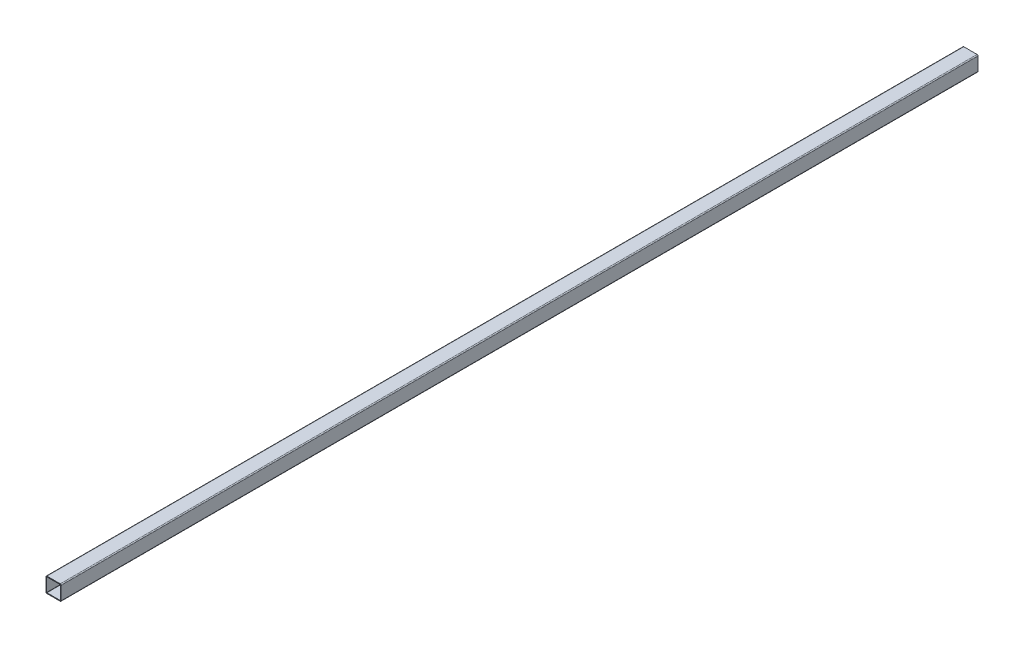
ISO-10303-21;
HEADER;
FILE_DESCRIPTION(('STEP AP214'),'2;1');
FILE_NAME('part.step','',(''),(''),'','','');
FILE_SCHEMA(('AUTOMOTIVE_DESIGN { 1 0 10303 214 1 1 1 1 }'));
ENDSEC;
DATA;
#1=APPLICATION_CONTEXT('core data for automotive mechanical design processes');
#2=APPLICATION_PROTOCOL_DEFINITION('international standard','automotive_design',2000,#1);
#3=PRODUCT_CONTEXT('',#1,'mechanical');
#4=PRODUCT('Part','Part','',(#3));
#5=PRODUCT_RELATED_PRODUCT_CATEGORY('part','',(#4));
#6=PRODUCT_DEFINITION_FORMATION('','',#4);
#7=PRODUCT_DEFINITION_CONTEXT('part definition',#1,'design');
#8=PRODUCT_DEFINITION('design','',#6,#7);
#9=PRODUCT_DEFINITION_SHAPE('','',#8);
#10=(LENGTH_UNIT() NAMED_UNIT(*) SI_UNIT(.MILLI.,.METRE.));
#11=(NAMED_UNIT(*) PLANE_ANGLE_UNIT() SI_UNIT($,.RADIAN.));
#12=(NAMED_UNIT(*) SI_UNIT($,.STERADIAN.) SOLID_ANGLE_UNIT());
#13=UNCERTAINTY_MEASURE_WITH_UNIT(LENGTH_MEASURE(1.E-05),#10,'distance_accuracy_value','');
#14=(GEOMETRIC_REPRESENTATION_CONTEXT(3) GLOBAL_UNCERTAINTY_ASSIGNED_CONTEXT((#13)) GLOBAL_UNIT_ASSIGNED_CONTEXT((#10,
#11,#12)) REPRESENTATION_CONTEXT('',''));
#15=CARTESIAN_POINT('',(0.,0.,0.));
#16=DIRECTION('',(0.,0.,1.));
#17=DIRECTION('',(1.,0.,0.));
#18=AXIS2_PLACEMENT_3D('',#15,#16,#17);
#19=CARTESIAN_POINT('',(14.,-14.,-968.));
#20=DIRECTION('',(0.,0.,1.));
#21=DIRECTION('',(1.,0.,0.));
#22=AXIS2_PLACEMENT_3D('',#19,#20,#21);
#23=CYLINDRICAL_SURFACE('',#22,2.);
#24=DIRECTION('',(0.,0.,1.));
#25=VECTOR('',#24,1.);
#26=CARTESIAN_POINT('',(16.,-14.,-968.));
#27=LINE('',#26,#25);
#28=CARTESIAN_POINT('',(16.,-14.,-968.));
#29=VERTEX_POINT('',#28);
#30=CARTESIAN_POINT('',(16.,-14.,968.));
#31=VERTEX_POINT('',#30);
#32=EDGE_CURVE('E37',#29,#31,#27,.T.);
#33=ORIENTED_EDGE('',*,*,#32,.T.);
#34=CARTESIAN_POINT('',(14.,-14.,968.));
#35=DIRECTION('',(0.,0.,1.));
#36=DIRECTION('',(1.,0.,0.));
#37=AXIS2_PLACEMENT_3D('',#34,#35,#36);
#38=CIRCLE('',#37,2.);
#39=CARTESIAN_POINT('',(14.,-16.,968.));
#40=VERTEX_POINT('',#39);
#41=EDGE_CURVE('E190',#40,#31,#38,.T.);
#42=ORIENTED_EDGE('',*,*,#41,.F.);
#43=DIRECTION('',(0.,0.,1.));
#44=VECTOR('',#43,1.);
#45=CARTESIAN_POINT('',(14.,-16.,-968.));
#46=LINE('',#45,#44);
#47=CARTESIAN_POINT('',(14.,-16.,-968.));
#48=VERTEX_POINT('',#47);
#49=EDGE_CURVE('E11',#48,#40,#46,.T.);
#50=ORIENTED_EDGE('',*,*,#49,.F.);
#51=CARTESIAN_POINT('',(14.,-14.,-968.));
#52=DIRECTION('',(0.,0.,1.));
#53=DIRECTION('',(1.,0.,0.));
#54=AXIS2_PLACEMENT_3D('',#51,#52,#53);
#55=CIRCLE('',#54,2.);
#56=EDGE_CURVE('E233',#48,#29,#55,.T.);
#57=ORIENTED_EDGE('',*,*,#56,.T.);
#58=EDGE_LOOP('',(#33,#42,#50,#57));
#59=FACE_BOUND('',#58,.T.);
#60=ADVANCED_FACE('F34',(#59),#23,.T.);
#61=CARTESIAN_POINT('',(-14.,-16.,-968.));
#62=DIRECTION('',(0.,-1.,0.));
#63=DIRECTION('',(0.,0.,-1.));
#64=AXIS2_PLACEMENT_3D('',#61,#62,#63);
#65=PLANE('',#64);
#66=ORIENTED_EDGE('',*,*,#49,.T.);
#67=DIRECTION('',(1.,0.,0.));
#68=VECTOR('',#67,1.);
#69=CARTESIAN_POINT('',(-14.,-16.,968.));
#70=LINE('',#69,#68);
#71=CARTESIAN_POINT('',(-14.,-16.,968.));
#72=VERTEX_POINT('',#71);
#73=EDGE_CURVE('E211',#72,#40,#70,.T.);
#74=ORIENTED_EDGE('',*,*,#73,.F.);
#75=DIRECTION('',(0.,0.,1.));
#76=VECTOR('',#75,1.);
#77=CARTESIAN_POINT('',(-14.,-16.,-968.));
#78=LINE('',#77,#76);
#79=CARTESIAN_POINT('',(-14.,-16.,-968.));
#80=VERTEX_POINT('',#79);
#81=EDGE_CURVE('E42',#80,#72,#78,.T.);
#82=ORIENTED_EDGE('',*,*,#81,.F.);
#83=DIRECTION('',(1.,0.,0.));
#84=VECTOR('',#83,1.);
#85=CARTESIAN_POINT('',(-14.,-16.,-968.));
#86=LINE('',#85,#84);
#87=EDGE_CURVE('E264',#80,#48,#86,.T.);
#88=ORIENTED_EDGE('',*,*,#87,.T.);
#89=EDGE_LOOP('',(#66,#74,#82,#88));
#90=FACE_BOUND('',#89,.T.);
#91=ADVANCED_FACE('F285',(#90),#65,.T.);
#92=CARTESIAN_POINT('',(-14.,-14.,-968.));
#93=DIRECTION('',(0.,0.,1.));
#94=DIRECTION('',(1.,0.,0.));
#95=AXIS2_PLACEMENT_3D('',#92,#93,#94);
#96=CYLINDRICAL_SURFACE('',#95,2.);
#97=ORIENTED_EDGE('',*,*,#81,.T.);
#98=CARTESIAN_POINT('',(-14.,-14.,968.));
#99=DIRECTION('',(0.,0.,1.));
#100=DIRECTION('',(1.,0.,0.));
#101=AXIS2_PLACEMENT_3D('',#98,#99,#100);
#102=CIRCLE('',#101,2.);
#103=CARTESIAN_POINT('',(-16.,-14.,968.));
#104=VERTEX_POINT('',#103);
#105=EDGE_CURVE('E208',#104,#72,#102,.T.);
#106=ORIENTED_EDGE('',*,*,#105,.F.);
#107=DIRECTION('',(0.,0.,1.));
#108=VECTOR('',#107,1.);
#109=CARTESIAN_POINT('',(-16.,-14.,-968.));
#110=LINE('',#109,#108);
#111=CARTESIAN_POINT('',(-16.,-14.,-968.));
#112=VERTEX_POINT('',#111);
#113=EDGE_CURVE('E268',#112,#104,#110,.T.);
#114=ORIENTED_EDGE('',*,*,#113,.F.);
#115=CARTESIAN_POINT('',(-14.,-14.,-968.));
#116=DIRECTION('',(0.,0.,1.));
#117=DIRECTION('',(1.,0.,0.));
#118=AXIS2_PLACEMENT_3D('',#115,#116,#117);
#119=CIRCLE('',#118,2.);
#120=EDGE_CURVE('E261',#112,#80,#119,.T.);
#121=ORIENTED_EDGE('',*,*,#120,.T.);
#122=EDGE_LOOP('',(#97,#106,#114,#121));
#123=FACE_BOUND('',#122,.T.);
#124=ADVANCED_FACE('F306',(#123),#96,.T.);
#125=CARTESIAN_POINT('',(-16.,-14.,-968.));
#126=DIRECTION('',(-1.,0.,0.));
#127=DIRECTION('',(0.,0.,1.));
#128=AXIS2_PLACEMENT_3D('',#125,#126,#127);
#129=PLANE('',#128);
#130=ORIENTED_EDGE('',*,*,#113,.T.);
#131=DIRECTION('',(0.,-1.,0.));
#132=VECTOR('',#131,1.);
#133=CARTESIAN_POINT('',(-16.,-14.,968.));
#134=LINE('',#133,#132);
#135=CARTESIAN_POINT('',(-16.,14.,968.));
#136=VERTEX_POINT('',#135);
#137=EDGE_CURVE('E205',#136,#104,#134,.T.);
#138=ORIENTED_EDGE('',*,*,#137,.F.);
#139=DIRECTION('',(0.,0.,1.));
#140=VECTOR('',#139,1.);
#141=CARTESIAN_POINT('',(-16.,14.,-968.));
#142=LINE('',#141,#140);
#143=CARTESIAN_POINT('',(-16.,14.,-968.));
#144=VERTEX_POINT('',#143);
#145=EDGE_CURVE('E270',#144,#136,#142,.T.);
#146=ORIENTED_EDGE('',*,*,#145,.F.);
#147=DIRECTION('',(0.,-1.,0.));
#148=VECTOR('',#147,1.);
#149=CARTESIAN_POINT('',(-16.,-14.,-968.));
#150=LINE('',#149,#148);
#151=EDGE_CURVE('E258',#144,#112,#150,.T.);
#152=ORIENTED_EDGE('',*,*,#151,.T.);
#153=EDGE_LOOP('',(#130,#138,#146,#152));
#154=FACE_BOUND('',#153,.T.);
#155=ADVANCED_FACE('F303',(#154),#129,.T.);
#156=CARTESIAN_POINT('',(-14.,14.,-968.));
#157=DIRECTION('',(0.,0.,1.));
#158=DIRECTION('',(1.,0.,0.));
#159=AXIS2_PLACEMENT_3D('',#156,#157,#158);
#160=CYLINDRICAL_SURFACE('',#159,2.);
#161=ORIENTED_EDGE('',*,*,#145,.T.);
#162=CARTESIAN_POINT('',(-14.,14.,968.));
#163=DIRECTION('',(0.,0.,1.));
#164=DIRECTION('',(-1.,0.,0.));
#165=AXIS2_PLACEMENT_3D('',#162,#163,#164);
#166=CIRCLE('',#165,2.);
#167=CARTESIAN_POINT('',(-14.,16.,968.));
#168=VERTEX_POINT('',#167);
#169=EDGE_CURVE('E202',#168,#136,#166,.T.);
#170=ORIENTED_EDGE('',*,*,#169,.F.);
#171=DIRECTION('',(0.,0.,1.));
#172=VECTOR('',#171,1.);
#173=CARTESIAN_POINT('',(-14.,16.,-968.));
#174=LINE('',#173,#172);
#175=CARTESIAN_POINT('',(-14.,16.,-968.));
#176=VERTEX_POINT('',#175);
#177=EDGE_CURVE('E272',#176,#168,#174,.T.);
#178=ORIENTED_EDGE('',*,*,#177,.F.);
#179=CARTESIAN_POINT('',(-14.,14.,-968.));
#180=DIRECTION('',(0.,0.,1.));
#181=DIRECTION('',(-1.,0.,0.));
#182=AXIS2_PLACEMENT_3D('',#179,#180,#181);
#183=CIRCLE('',#182,2.);
#184=EDGE_CURVE('E255',#176,#144,#183,.T.);
#185=ORIENTED_EDGE('',*,*,#184,.T.);
#186=EDGE_LOOP('',(#161,#170,#178,#185));
#187=FACE_BOUND('',#186,.T.);
#188=ADVANCED_FACE('F301',(#187),#160,.T.);
#189=CARTESIAN_POINT('',(-14.,16.,-968.));
#190=DIRECTION('',(0.,1.,0.));
#191=DIRECTION('',(0.,0.,1.));
#192=AXIS2_PLACEMENT_3D('',#189,#190,#191);
#193=PLANE('',#192);
#194=ORIENTED_EDGE('',*,*,#177,.T.);
#195=DIRECTION('',(-1.,0.,0.));
#196=VECTOR('',#195,1.);
#197=CARTESIAN_POINT('',(-14.,16.,968.));
#198=LINE('',#197,#196);
#199=CARTESIAN_POINT('',(14.,16.,968.));
#200=VERTEX_POINT('',#199);
#201=EDGE_CURVE('E199',#200,#168,#198,.T.);
#202=ORIENTED_EDGE('',*,*,#201,.F.);
#203=DIRECTION('',(0.,0.,1.));
#204=VECTOR('',#203,1.);
#205=CARTESIAN_POINT('',(14.,16.,-968.));
#206=LINE('',#205,#204);
#207=CARTESIAN_POINT('',(14.,16.,-968.));
#208=VERTEX_POINT('',#207);
#209=EDGE_CURVE('E274',#208,#200,#206,.T.);
#210=ORIENTED_EDGE('',*,*,#209,.F.);
#211=DIRECTION('',(-1.,0.,0.));
#212=VECTOR('',#211,1.);
#213=CARTESIAN_POINT('',(-14.,16.,-968.));
#214=LINE('',#213,#212);
#215=EDGE_CURVE('E252',#208,#176,#214,.T.);
#216=ORIENTED_EDGE('',*,*,#215,.T.);
#217=EDGE_LOOP('',(#194,#202,#210,#216));
#218=FACE_BOUND('',#217,.T.);
#219=ADVANCED_FACE('F299',(#218),#193,.T.);
#220=CARTESIAN_POINT('',(14.,14.,-968.));
#221=DIRECTION('',(0.,0.,1.));
#222=DIRECTION('',(1.,0.,0.));
#223=AXIS2_PLACEMENT_3D('',#220,#221,#222);
#224=CYLINDRICAL_SURFACE('',#223,2.);
#225=ORIENTED_EDGE('',*,*,#209,.T.);
#226=CARTESIAN_POINT('',(14.,14.,968.));
#227=DIRECTION('',(0.,0.,1.));
#228=DIRECTION('',(1.,0.,0.));
#229=AXIS2_PLACEMENT_3D('',#226,#227,#228);
#230=CIRCLE('',#229,2.);
#231=CARTESIAN_POINT('',(16.,14.,968.));
#232=VERTEX_POINT('',#231);
#233=EDGE_CURVE('E196',#232,#200,#230,.T.);
#234=ORIENTED_EDGE('',*,*,#233,.F.);
#235=DIRECTION('',(0.,0.,1.));
#236=VECTOR('',#235,1.);
#237=CARTESIAN_POINT('',(16.,14.,-968.));
#238=LINE('',#237,#236);
#239=CARTESIAN_POINT('',(16.,14.,-968.));
#240=VERTEX_POINT('',#239);
#241=EDGE_CURVE('E275',#240,#232,#238,.T.);
#242=ORIENTED_EDGE('',*,*,#241,.F.);
#243=CARTESIAN_POINT('',(14.,14.,-968.));
#244=DIRECTION('',(0.,0.,1.));
#245=DIRECTION('',(1.,0.,0.));
#246=AXIS2_PLACEMENT_3D('',#243,#244,#245);
#247=CIRCLE('',#246,2.);
#248=EDGE_CURVE('E249',#240,#208,#247,.T.);
#249=ORIENTED_EDGE('',*,*,#248,.T.);
#250=EDGE_LOOP('',(#225,#234,#242,#249));
#251=FACE_BOUND('',#250,.T.);
#252=ADVANCED_FACE('F295',(#251),#224,.T.);
#253=CARTESIAN_POINT('',(16.,-14.,-968.));
#254=DIRECTION('',(1.,0.,0.));
#255=DIRECTION('',(0.,0.,-1.));
#256=AXIS2_PLACEMENT_3D('',#253,#254,#255);
#257=PLANE('',#256);
#258=ORIENTED_EDGE('',*,*,#241,.T.);
#259=DIRECTION('',(0.,1.,0.));
#260=VECTOR('',#259,1.);
#261=CARTESIAN_POINT('',(16.,-14.,968.));
#262=LINE('',#261,#260);
#263=EDGE_CURVE('E193',#31,#232,#262,.T.);
#264=ORIENTED_EDGE('',*,*,#263,.F.);
#265=ORIENTED_EDGE('',*,*,#32,.F.);
#266=DIRECTION('',(0.,1.,0.));
#267=VECTOR('',#266,1.);
#268=CARTESIAN_POINT('',(16.,-14.,-968.));
#269=LINE('',#268,#267);
#270=EDGE_CURVE('E246',#29,#240,#269,.T.);
#271=ORIENTED_EDGE('',*,*,#270,.T.);
#272=EDGE_LOOP('',(#258,#264,#265,#271));
#273=FACE_BOUND('',#272,.T.);
#274=ADVANCED_FACE('F279',(#273),#257,.T.);
#275=CARTESIAN_POINT('',(14.,-14.,-968.));
#276=DIRECTION('',(0.,0.,1.));
#277=DIRECTION('',(1.,0.,0.));
#278=AXIS2_PLACEMENT_3D('',#275,#276,#277);
#279=PLANE('',#278);
#280=DIRECTION('',(-1.,0.,0.));
#281=VECTOR('',#280,1.);
#282=CARTESIAN_POINT('',(-14.,14.48,-968.));
#283=LINE('',#282,#281);
#284=CARTESIAN_POINT('',(14.,14.48,-968.));
#285=VERTEX_POINT('',#284);
#286=CARTESIAN_POINT('',(-14.,14.48,-968.));
#287=VERTEX_POINT('',#286);
#288=EDGE_CURVE('E159',#285,#287,#283,.T.);
#289=ORIENTED_EDGE('',*,*,#288,.T.);
#290=CARTESIAN_POINT('',(-14.,14.,-968.));
#291=DIRECTION('',(0.,0.,1.));
#292=DIRECTION('',(-1.,0.,0.));
#293=AXIS2_PLACEMENT_3D('',#290,#291,#292);
#294=CIRCLE('',#293,0.48);
#295=CARTESIAN_POINT('',(-14.48,14.,-968.));
#296=VERTEX_POINT('',#295);
#297=EDGE_CURVE('E214',#287,#296,#294,.T.);
#298=ORIENTED_EDGE('',*,*,#297,.T.);
#299=DIRECTION('',(0.,-1.,0.));
#300=VECTOR('',#299,1.);
#301=CARTESIAN_POINT('',(-14.48,-14.,-968.));
#302=LINE('',#301,#300);
#303=CARTESIAN_POINT('',(-14.48,-14.,-968.));
#304=VERTEX_POINT('',#303);
#305=EDGE_CURVE('E154',#296,#304,#302,.T.);
#306=ORIENTED_EDGE('',*,*,#305,.T.);
#307=CARTESIAN_POINT('',(-14.,-14.,-968.));
#308=DIRECTION('',(0.,0.,1.));
#309=DIRECTION('',(1.,0.,0.));
#310=AXIS2_PLACEMENT_3D('',#307,#308,#309);
#311=CIRCLE('',#310,0.48);
#312=CARTESIAN_POINT('',(-14.,-14.48,-968.));
#313=VERTEX_POINT('',#312);
#314=EDGE_CURVE('E50',#304,#313,#311,.T.);
#315=ORIENTED_EDGE('',*,*,#314,.T.);
#316=DIRECTION('',(1.,0.,0.));
#317=VECTOR('',#316,1.);
#318=CARTESIAN_POINT('',(-14.,-14.48,-968.));
#319=LINE('',#318,#317);
#320=CARTESIAN_POINT('',(14.,-14.48,-968.));
#321=VERTEX_POINT('',#320);
#322=EDGE_CURVE('E218',#313,#321,#319,.T.);
#323=ORIENTED_EDGE('',*,*,#322,.T.);
#324=CARTESIAN_POINT('',(14.,-14.,-968.));
#325=DIRECTION('',(0.,0.,1.));
#326=DIRECTION('',(1.,0.,0.));
#327=AXIS2_PLACEMENT_3D('',#324,#325,#326);
#328=CIRCLE('',#327,0.48);
#329=CARTESIAN_POINT('',(14.48,-14.,-968.));
#330=VERTEX_POINT('',#329);
#331=EDGE_CURVE('E221',#321,#330,#328,.T.);
#332=ORIENTED_EDGE('',*,*,#331,.T.);
#333=DIRECTION('',(0.,1.,0.));
#334=VECTOR('',#333,1.);
#335=CARTESIAN_POINT('',(14.48,-14.,-968.));
#336=LINE('',#335,#334);
#337=CARTESIAN_POINT('',(14.48,14.,-968.));
#338=VERTEX_POINT('',#337);
#339=EDGE_CURVE('E224',#330,#338,#336,.T.);
#340=ORIENTED_EDGE('',*,*,#339,.T.);
#341=CARTESIAN_POINT('',(14.,14.,-968.));
#342=DIRECTION('',(0.,0.,1.));
#343=DIRECTION('',(1.,0.,0.));
#344=AXIS2_PLACEMENT_3D('',#341,#342,#343);
#345=CIRCLE('',#344,0.48);
#346=EDGE_CURVE('E227',#338,#285,#345,.T.);
#347=ORIENTED_EDGE('',*,*,#346,.T.);
#348=EDGE_LOOP('',(#289,#298,#306,#315,#323,#332,#340,#347));
#349=FACE_BOUND('',#348,.T.);
#350=ORIENTED_EDGE('',*,*,#56,.F.);
#351=ORIENTED_EDGE('',*,*,#87,.F.);
#352=ORIENTED_EDGE('',*,*,#120,.F.);
#353=ORIENTED_EDGE('',*,*,#151,.F.);
#354=ORIENTED_EDGE('',*,*,#184,.F.);
#355=ORIENTED_EDGE('',*,*,#215,.F.);
#356=ORIENTED_EDGE('',*,*,#248,.F.);
#357=ORIENTED_EDGE('',*,*,#270,.F.);
#358=EDGE_LOOP('',(#350,#351,#352,#353,#354,#355,#356,#357));
#359=FACE_BOUND('',#358,.T.);
#360=ADVANCED_FACE('F289',(#349,#359),#279,.F.);
#361=CARTESIAN_POINT('',(-14.,14.,-968.));
#362=DIRECTION('',(0.,0.,1.));
#363=DIRECTION('',(1.,0.,0.));
#364=AXIS2_PLACEMENT_3D('',#361,#362,#363);
#365=CYLINDRICAL_SURFACE('',#364,0.48);
#366=DIRECTION('',(0.,0.,1.));
#367=VECTOR('',#366,1.);
#368=CARTESIAN_POINT('',(-14.,14.48,-968.));
#369=LINE('',#368,#367);
#370=CARTESIAN_POINT('',(-14.,14.48,968.));
#371=VERTEX_POINT('',#370);
#372=EDGE_CURVE('E164',#287,#371,#369,.T.);
#373=ORIENTED_EDGE('',*,*,#372,.T.);
#374=CARTESIAN_POINT('',(-14.,14.,968.));
#375=DIRECTION('',(0.,0.,1.));
#376=DIRECTION('',(-1.,0.,0.));
#377=AXIS2_PLACEMENT_3D('',#374,#375,#376);
#378=CIRCLE('',#377,0.48);
#379=CARTESIAN_POINT('',(-14.48,14.,968.));
#380=VERTEX_POINT('',#379);
#381=EDGE_CURVE('E162',#371,#380,#378,.T.);
#382=ORIENTED_EDGE('',*,*,#381,.T.);
#383=DIRECTION('',(0.,0.,1.));
#384=VECTOR('',#383,1.);
#385=CARTESIAN_POINT('',(-14.48,14.,-968.));
#386=LINE('',#385,#384);
#387=EDGE_CURVE('E147',#296,#380,#386,.T.);
#388=ORIENTED_EDGE('',*,*,#387,.F.);
#389=ORIENTED_EDGE('',*,*,#297,.F.);
#390=EDGE_LOOP('',(#373,#382,#388,#389));
#391=FACE_BOUND('',#390,.T.);
#392=ADVANCED_FACE('F163',(#391),#365,.F.);
#393=CARTESIAN_POINT('',(-14.,14.48,-968.));
#394=DIRECTION('',(0.,1.,0.));
#395=DIRECTION('',(0.,0.,1.));
#396=AXIS2_PLACEMENT_3D('',#393,#394,#395);
#397=PLANE('',#396);
#398=DIRECTION('',(0.,0.,1.));
#399=VECTOR('',#398,1.);
#400=CARTESIAN_POINT('',(14.,14.48,-968.));
#401=LINE('',#400,#399);
#402=CARTESIAN_POINT('',(14.,14.48,968.));
#403=VERTEX_POINT('',#402);
#404=EDGE_CURVE('E234',#285,#403,#401,.T.);
#405=ORIENTED_EDGE('',*,*,#404,.T.);
#406=DIRECTION('',(-1.,0.,0.));
#407=VECTOR('',#406,1.);
#408=CARTESIAN_POINT('',(-14.,14.48,968.));
#409=LINE('',#408,#407);
#410=EDGE_CURVE('E188',#403,#371,#409,.T.);
#411=ORIENTED_EDGE('',*,*,#410,.T.);
#412=ORIENTED_EDGE('',*,*,#372,.F.);
#413=ORIENTED_EDGE('',*,*,#288,.F.);
#414=EDGE_LOOP('',(#405,#411,#412,#413));
#415=FACE_BOUND('',#414,.T.);
#416=ADVANCED_FACE('F381',(#415),#397,.F.);
#417=CARTESIAN_POINT('',(14.,14.,-968.));
#418=DIRECTION('',(0.,0.,1.));
#419=DIRECTION('',(1.,0.,0.));
#420=AXIS2_PLACEMENT_3D('',#417,#418,#419);
#421=CYLINDRICAL_SURFACE('',#420,0.48);
#422=DIRECTION('',(0.,0.,1.));
#423=VECTOR('',#422,1.);
#424=CARTESIAN_POINT('',(14.48,14.,-968.));
#425=LINE('',#424,#423);
#426=CARTESIAN_POINT('',(14.48,14.,968.));
#427=VERTEX_POINT('',#426);
#428=EDGE_CURVE('E236',#338,#427,#425,.T.);
#429=ORIENTED_EDGE('',*,*,#428,.T.);
#430=CARTESIAN_POINT('',(14.,14.,968.));
#431=DIRECTION('',(0.,0.,1.));
#432=DIRECTION('',(1.,0.,0.));
#433=AXIS2_PLACEMENT_3D('',#430,#431,#432);
#434=CIRCLE('',#433,0.48);
#435=EDGE_CURVE('E185',#427,#403,#434,.T.);
#436=ORIENTED_EDGE('',*,*,#435,.T.);
#437=ORIENTED_EDGE('',*,*,#404,.F.);
#438=ORIENTED_EDGE('',*,*,#346,.F.);
#439=EDGE_LOOP('',(#429,#436,#437,#438));
#440=FACE_BOUND('',#439,.T.);
#441=ADVANCED_FACE('F390',(#440),#421,.F.);
#442=CARTESIAN_POINT('',(14.48,-14.,-968.));
#443=DIRECTION('',(1.,0.,0.));
#444=DIRECTION('',(0.,0.,-1.));
#445=AXIS2_PLACEMENT_3D('',#442,#443,#444);
#446=PLANE('',#445);
#447=DIRECTION('',(0.,0.,1.));
#448=VECTOR('',#447,1.);
#449=CARTESIAN_POINT('',(14.48,-14.,-968.));
#450=LINE('',#449,#448);
#451=CARTESIAN_POINT('',(14.48,-14.,968.));
#452=VERTEX_POINT('',#451);
#453=EDGE_CURVE('E238',#330,#452,#450,.T.);
#454=ORIENTED_EDGE('',*,*,#453,.T.);
#455=DIRECTION('',(0.,1.,0.));
#456=VECTOR('',#455,1.);
#457=CARTESIAN_POINT('',(14.48,-14.,968.));
#458=LINE('',#457,#456);
#459=EDGE_CURVE('E182',#452,#427,#458,.T.);
#460=ORIENTED_EDGE('',*,*,#459,.T.);
#461=ORIENTED_EDGE('',*,*,#428,.F.);
#462=ORIENTED_EDGE('',*,*,#339,.F.);
#463=EDGE_LOOP('',(#454,#460,#461,#462));
#464=FACE_BOUND('',#463,.T.);
#465=ADVANCED_FACE('F400',(#464),#446,.F.);
#466=CARTESIAN_POINT('',(14.,-14.,-968.));
#467=DIRECTION('',(0.,0.,1.));
#468=DIRECTION('',(1.,0.,0.));
#469=AXIS2_PLACEMENT_3D('',#466,#467,#468);
#470=CYLINDRICAL_SURFACE('',#469,0.48);
#471=DIRECTION('',(0.,0.,1.));
#472=VECTOR('',#471,1.);
#473=CARTESIAN_POINT('',(14.,-14.48,-968.));
#474=LINE('',#473,#472);
#475=CARTESIAN_POINT('',(14.,-14.48,968.));
#476=VERTEX_POINT('',#475);
#477=EDGE_CURVE('E240',#321,#476,#474,.T.);
#478=ORIENTED_EDGE('',*,*,#477,.T.);
#479=CARTESIAN_POINT('',(14.,-14.,968.));
#480=DIRECTION('',(0.,0.,1.));
#481=DIRECTION('',(1.,0.,0.));
#482=AXIS2_PLACEMENT_3D('',#479,#480,#481);
#483=CIRCLE('',#482,0.48);
#484=EDGE_CURVE('E179',#476,#452,#483,.T.);
#485=ORIENTED_EDGE('',*,*,#484,.T.);
#486=ORIENTED_EDGE('',*,*,#453,.F.);
#487=ORIENTED_EDGE('',*,*,#331,.F.);
#488=EDGE_LOOP('',(#478,#485,#486,#487));
#489=FACE_BOUND('',#488,.T.);
#490=ADVANCED_FACE('F410',(#489),#470,.F.);
#491=CARTESIAN_POINT('',(-14.,-14.48,-968.));
#492=DIRECTION('',(0.,-1.,0.));
#493=DIRECTION('',(0.,0.,-1.));
#494=AXIS2_PLACEMENT_3D('',#491,#492,#493);
#495=PLANE('',#494);
#496=DIRECTION('',(0.,0.,1.));
#497=VECTOR('',#496,1.);
#498=CARTESIAN_POINT('',(-14.,-14.48,-968.));
#499=LINE('',#498,#497);
#500=CARTESIAN_POINT('',(-14.,-14.48,968.));
#501=VERTEX_POINT('',#500);
#502=EDGE_CURVE('E242',#313,#501,#499,.T.);
#503=ORIENTED_EDGE('',*,*,#502,.T.);
#504=DIRECTION('',(1.,0.,0.));
#505=VECTOR('',#504,1.);
#506=CARTESIAN_POINT('',(-14.,-14.48,968.));
#507=LINE('',#506,#505);
#508=EDGE_CURVE('E174',#501,#476,#507,.T.);
#509=ORIENTED_EDGE('',*,*,#508,.T.);
#510=ORIENTED_EDGE('',*,*,#477,.F.);
#511=ORIENTED_EDGE('',*,*,#322,.F.);
#512=EDGE_LOOP('',(#503,#509,#510,#511));
#513=FACE_BOUND('',#512,.T.);
#514=ADVANCED_FACE('F420',(#513),#495,.F.);
#515=CARTESIAN_POINT('',(-14.,-14.,-968.));
#516=DIRECTION('',(0.,0.,1.));
#517=DIRECTION('',(1.,0.,0.));
#518=AXIS2_PLACEMENT_3D('',#515,#516,#517);
#519=CYLINDRICAL_SURFACE('',#518,0.48);
#520=DIRECTION('',(0.,0.,1.));
#521=VECTOR('',#520,1.);
#522=CARTESIAN_POINT('',(-14.48,-14.,-968.));
#523=LINE('',#522,#521);
#524=CARTESIAN_POINT('',(-14.48,-14.,968.));
#525=VERTEX_POINT('',#524);
#526=EDGE_CURVE('E158',#304,#525,#523,.T.);
#527=ORIENTED_EDGE('',*,*,#526,.T.);
#528=CARTESIAN_POINT('',(-14.,-14.,968.));
#529=DIRECTION('',(0.,0.,1.));
#530=DIRECTION('',(1.,0.,0.));
#531=AXIS2_PLACEMENT_3D('',#528,#529,#530);
#532=CIRCLE('',#531,0.48);
#533=EDGE_CURVE('E172',#525,#501,#532,.T.);
#534=ORIENTED_EDGE('',*,*,#533,.T.);
#535=ORIENTED_EDGE('',*,*,#502,.F.);
#536=ORIENTED_EDGE('',*,*,#314,.F.);
#537=EDGE_LOOP('',(#527,#534,#535,#536));
#538=FACE_BOUND('',#537,.T.);
#539=ADVANCED_FACE('F430',(#538),#519,.F.);
#540=CARTESIAN_POINT('',(-14.48,-14.,-968.));
#541=DIRECTION('',(-1.,0.,0.));
#542=DIRECTION('',(0.,0.,1.));
#543=AXIS2_PLACEMENT_3D('',#540,#541,#542);
#544=PLANE('',#543);
#545=ORIENTED_EDGE('',*,*,#387,.T.);
#546=DIRECTION('',(0.,-1.,0.));
#547=VECTOR('',#546,1.);
#548=CARTESIAN_POINT('',(-14.48,-14.,968.));
#549=LINE('',#548,#547);
#550=EDGE_CURVE('E151',#380,#525,#549,.T.);
#551=ORIENTED_EDGE('',*,*,#550,.T.);
#552=ORIENTED_EDGE('',*,*,#526,.F.);
#553=ORIENTED_EDGE('',*,*,#305,.F.);
#554=EDGE_LOOP('',(#545,#551,#552,#553));
#555=FACE_BOUND('',#554,.T.);
#556=ADVANCED_FACE('F149',(#555),#544,.F.);
#557=CARTESIAN_POINT('',(14.,-14.,968.));
#558=DIRECTION('',(0.,0.,1.));
#559=DIRECTION('',(1.,0.,0.));
#560=AXIS2_PLACEMENT_3D('',#557,#558,#559);
#561=PLANE('',#560);
#562=ORIENTED_EDGE('',*,*,#41,.T.);
#563=ORIENTED_EDGE('',*,*,#263,.T.);
#564=ORIENTED_EDGE('',*,*,#233,.T.);
#565=ORIENTED_EDGE('',*,*,#201,.T.);
#566=ORIENTED_EDGE('',*,*,#169,.T.);
#567=ORIENTED_EDGE('',*,*,#137,.T.);
#568=ORIENTED_EDGE('',*,*,#105,.T.);
#569=ORIENTED_EDGE('',*,*,#73,.T.);
#570=EDGE_LOOP('',(#562,#563,#564,#565,#566,#567,#568,#569));
#571=FACE_BOUND('',#570,.T.);
#572=ORIENTED_EDGE('',*,*,#550,.F.);
#573=ORIENTED_EDGE('',*,*,#381,.F.);
#574=ORIENTED_EDGE('',*,*,#410,.F.);
#575=ORIENTED_EDGE('',*,*,#435,.F.);
#576=ORIENTED_EDGE('',*,*,#459,.F.);
#577=ORIENTED_EDGE('',*,*,#484,.F.);
#578=ORIENTED_EDGE('',*,*,#508,.F.);
#579=ORIENTED_EDGE('',*,*,#533,.F.);
#580=EDGE_LOOP('',(#572,#573,#574,#575,#576,#577,#578,#579));
#581=FACE_BOUND('',#580,.T.);
#582=ADVANCED_FACE('F169',(#571,#581),#561,.T.);
#583=CLOSED_SHELL('',(#60,#91,#124,#155,#188,#219,#252,#274,#360,#392,#416,#441,#465,#490,#514,
#539,#556,#582));
#584=MANIFOLD_SOLID_BREP('B2',#583);
#585=ADVANCED_BREP_SHAPE_REPRESENTATION('',(#18,#584),#14);
#586=SHAPE_DEFINITION_REPRESENTATION(#9,#585);
ENDSEC;
END-ISO-10303-21;
